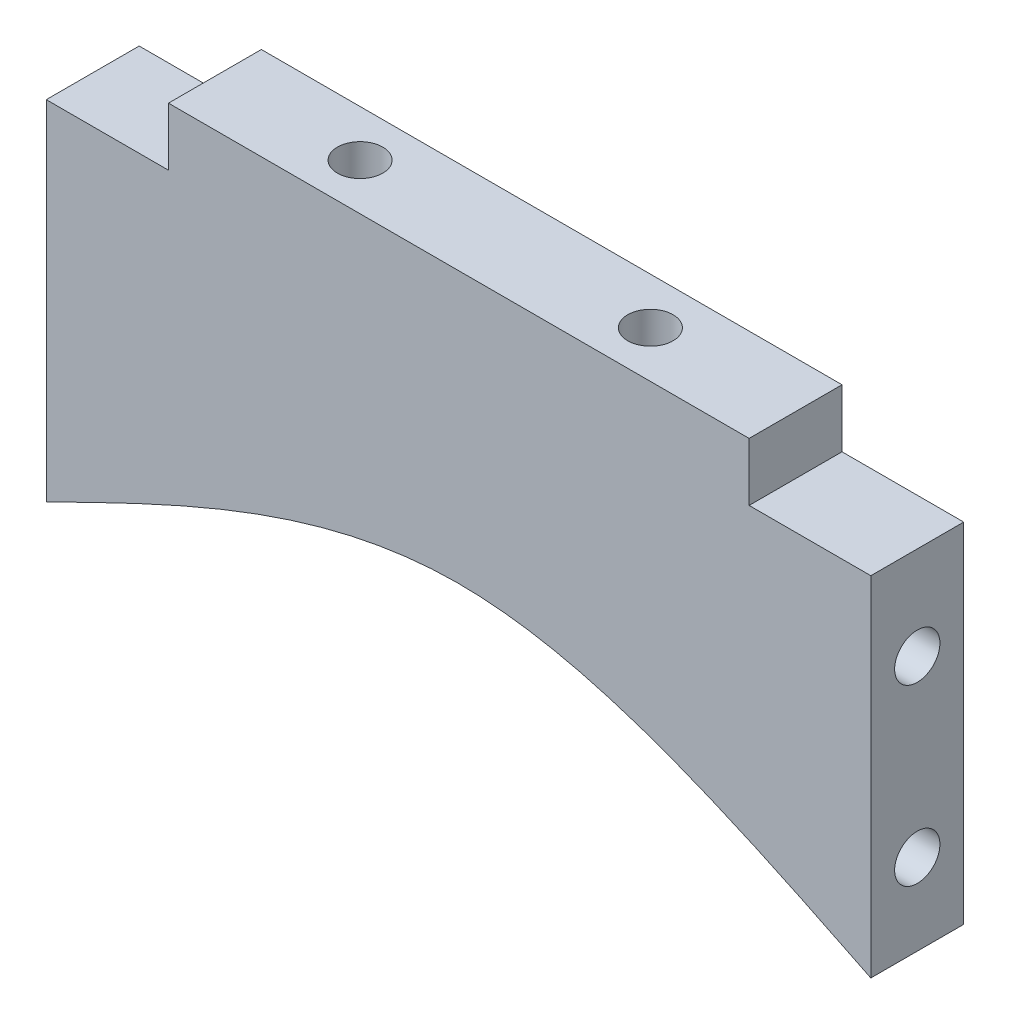
ISO-10303-21;
HEADER;
FILE_DESCRIPTION(('STEP AP214'),'2;1');
FILE_NAME('part.step','',(''),(''),'','','');
FILE_SCHEMA(('AUTOMOTIVE_DESIGN { 1 0 10303 214 1 1 1 1 }'));
ENDSEC;
DATA;
#1=APPLICATION_CONTEXT('core data for automotive mechanical design processes');
#2=APPLICATION_PROTOCOL_DEFINITION('international standard','automotive_design',2000,#1);
#3=PRODUCT_CONTEXT('',#1,'mechanical');
#4=PRODUCT('Part','Part','',(#3));
#5=PRODUCT_RELATED_PRODUCT_CATEGORY('part','',(#4));
#6=PRODUCT_DEFINITION_FORMATION('','',#4);
#7=PRODUCT_DEFINITION_CONTEXT('part definition',#1,'design');
#8=PRODUCT_DEFINITION('design','',#6,#7);
#9=PRODUCT_DEFINITION_SHAPE('','',#8);
#10=(LENGTH_UNIT() NAMED_UNIT(*) SI_UNIT(.MILLI.,.METRE.));
#11=(NAMED_UNIT(*) PLANE_ANGLE_UNIT() SI_UNIT($,.RADIAN.));
#12=(NAMED_UNIT(*) SI_UNIT($,.STERADIAN.) SOLID_ANGLE_UNIT());
#13=UNCERTAINTY_MEASURE_WITH_UNIT(LENGTH_MEASURE(1.E-05),#10,'distance_accuracy_value','');
#14=(GEOMETRIC_REPRESENTATION_CONTEXT(3) GLOBAL_UNCERTAINTY_ASSIGNED_CONTEXT((#13)) GLOBAL_UNIT_ASSIGNED_CONTEXT((#10,
#11,#12)) REPRESENTATION_CONTEXT('',''));
#15=CARTESIAN_POINT('',(0.,0.,0.));
#16=DIRECTION('',(0.,0.,1.));
#17=DIRECTION('',(1.,0.,0.));
#18=AXIS2_PLACEMENT_3D('',#15,#16,#17);
#19=CARTESIAN_POINT('',(-45.7784592925291,10.84478982375,8.));
#20=DIRECTION('',(1.,0.,0.));
#21=DIRECTION('',(0.,1.,0.));
#22=AXIS2_PLACEMENT_3D('',#19,#20,#21);
#23=PLANE('',#22);
#24=CARTESIAN_POINT('',(-45.7784592925291,-12.15521017625,4.));
#25=DIRECTION('',(-1.,0.,0.));
#26=DIRECTION('',(0.,-1.,0.));
#27=AXIS2_PLACEMENT_3D('',#24,#25,#26);
#28=CIRCLE('',#27,1.95);
#29=CARTESIAN_POINT('',(-45.7784592925291,-14.10521017625,4.));
#30=VERTEX_POINT('',#29);
#31=EDGE_CURVE('E297',#30,#30,#28,.T.);
#32=ORIENTED_EDGE('',*,*,#31,.F.);
#33=EDGE_LOOP('',(#32));
#34=FACE_BOUND('',#33,.T.);
#35=CARTESIAN_POINT('',(-45.7784592925291,2.84478982375002,4.));
#36=DIRECTION('',(-1.,0.,0.));
#37=DIRECTION('',(0.,-1.,0.));
#38=AXIS2_PLACEMENT_3D('',#35,#36,#37);
#39=CIRCLE('',#38,1.95);
#40=CARTESIAN_POINT('',(-45.7784592925291,0.894789823750017,4.));
#41=VERTEX_POINT('',#40);
#42=EDGE_CURVE('E296',#41,#41,#39,.T.);
#43=ORIENTED_EDGE('',*,*,#42,.F.);
#44=EDGE_LOOP('',(#43));
#45=FACE_BOUND('',#44,.T.);
#46=DIRECTION('',(0.,-1.,0.));
#47=VECTOR('',#46,1.);
#48=CARTESIAN_POINT('',(-45.7784592925291,10.84478982375,0.));
#49=LINE('',#48,#47);
#50=CARTESIAN_POINT('',(-45.7784592925291,10.84478982375,0.));
#51=VERTEX_POINT('',#50);
#52=CARTESIAN_POINT('',(-45.7784592925291,-19.15521017625,0.));
#53=VERTEX_POINT('',#52);
#54=EDGE_CURVE('E121',#51,#53,#49,.T.);
#55=ORIENTED_EDGE('',*,*,#54,.T.);
#56=DIRECTION('',(0.,0.,-1.));
#57=VECTOR('',#56,1.);
#58=CARTESIAN_POINT('',(-45.7784592925291,-19.15521017625,8.));
#59=LINE('',#58,#57);
#60=CARTESIAN_POINT('',(-45.7784592925291,-19.15521017625,8.));
#61=VERTEX_POINT('',#60);
#62=EDGE_CURVE('E11',#61,#53,#59,.T.);
#63=ORIENTED_EDGE('',*,*,#62,.F.);
#64=DIRECTION('',(0.,-1.,0.));
#65=VECTOR('',#64,1.);
#66=CARTESIAN_POINT('',(-45.7784592925291,10.84478982375,8.));
#67=LINE('',#66,#65);
#68=CARTESIAN_POINT('',(-45.7784592925291,10.84478982375,8.));
#69=VERTEX_POINT('',#68);
#70=EDGE_CURVE('E134',#69,#61,#67,.T.);
#71=ORIENTED_EDGE('',*,*,#70,.F.);
#72=DIRECTION('',(0.,0.,-1.));
#73=VECTOR('',#72,1.);
#74=CARTESIAN_POINT('',(-45.7784592925291,10.84478982375,8.));
#75=LINE('',#74,#73);
#76=EDGE_CURVE('E117',#69,#51,#75,.T.);
#77=ORIENTED_EDGE('',*,*,#76,.T.);
#78=EDGE_LOOP('',(#55,#63,#71,#77));
#79=FACE_BOUND('',#78,.T.);
#80=ADVANCED_FACE('F30',(#34,#45,#79),#23,.F.);
#81=CARTESIAN_POINT('',(25.2215407074709,10.84478982375,8.));
#82=DIRECTION('',(-1.,0.,0.));
#83=DIRECTION('',(0.,-1.,0.));
#84=AXIS2_PLACEMENT_3D('',#81,#82,#83);
#85=PLANE('',#84);
#86=CARTESIAN_POINT('',(25.2215407074709,-12.15521017625,4.));
#87=DIRECTION('',(1.,0.,0.));
#88=DIRECTION('',(0.,1.,0.));
#89=AXIS2_PLACEMENT_3D('',#86,#87,#88);
#90=CIRCLE('',#89,1.95);
#91=CARTESIAN_POINT('',(25.2215407074709,-10.20521017625,4.));
#92=VERTEX_POINT('',#91);
#93=EDGE_CURVE('E217',#92,#92,#90,.T.);
#94=ORIENTED_EDGE('',*,*,#93,.F.);
#95=EDGE_LOOP('',(#94));
#96=FACE_BOUND('',#95,.T.);
#97=CARTESIAN_POINT('',(25.2215407074709,2.84478982375003,4.));
#98=DIRECTION('',(1.,0.,0.));
#99=DIRECTION('',(0.,1.,0.));
#100=AXIS2_PLACEMENT_3D('',#97,#98,#99);
#101=CIRCLE('',#100,1.95);
#102=CARTESIAN_POINT('',(25.2215407074709,4.79478982375003,4.));
#103=VERTEX_POINT('',#102);
#104=EDGE_CURVE('E220',#103,#103,#101,.T.);
#105=ORIENTED_EDGE('',*,*,#104,.F.);
#106=EDGE_LOOP('',(#105));
#107=FACE_BOUND('',#106,.T.);
#108=DIRECTION('',(0.,1.,0.));
#109=VECTOR('',#108,1.);
#110=CARTESIAN_POINT('',(25.2215407074709,10.84478982375,0.));
#111=LINE('',#110,#109);
#112=CARTESIAN_POINT('',(25.2215407074709,-19.15521017625,0.));
#113=VERTEX_POINT('',#112);
#114=CARTESIAN_POINT('',(25.2215407074709,10.84478982375,0.));
#115=VERTEX_POINT('',#114);
#116=EDGE_CURVE('E124',#113,#115,#111,.T.);
#117=ORIENTED_EDGE('',*,*,#116,.T.);
#118=DIRECTION('',(0.,0.,-1.));
#119=VECTOR('',#118,1.);
#120=CARTESIAN_POINT('',(25.2215407074709,10.84478982375,8.));
#121=LINE('',#120,#119);
#122=CARTESIAN_POINT('',(25.2215407074709,10.84478982375,8.));
#123=VERTEX_POINT('',#122);
#124=EDGE_CURVE('E141',#123,#115,#121,.T.);
#125=ORIENTED_EDGE('',*,*,#124,.F.);
#126=DIRECTION('',(0.,1.,0.));
#127=VECTOR('',#126,1.);
#128=CARTESIAN_POINT('',(25.2215407074709,10.84478982375,8.));
#129=LINE('',#128,#127);
#130=CARTESIAN_POINT('',(25.2215407074709,-19.15521017625,8.));
#131=VERTEX_POINT('',#130);
#132=EDGE_CURVE('E86',#131,#123,#129,.T.);
#133=ORIENTED_EDGE('',*,*,#132,.F.);
#134=DIRECTION('',(0.,0.,-1.));
#135=VECTOR('',#134,1.);
#136=CARTESIAN_POINT('',(25.2215407074709,-19.15521017625,8.));
#137=LINE('',#136,#135);
#138=EDGE_CURVE('E38',#131,#113,#137,.T.);
#139=ORIENTED_EDGE('',*,*,#138,.T.);
#140=EDGE_LOOP('',(#117,#125,#133,#139));
#141=FACE_BOUND('',#140,.T.);
#142=ADVANCED_FACE('F147',(#96,#107,#141),#85,.F.);
#143=CARTESIAN_POINT('',(14.7422960266042,10.84478982375,8.));
#144=DIRECTION('',(0.,-1.,0.));
#145=DIRECTION('',(0.,0.,-1.));
#146=AXIS2_PLACEMENT_3D('',#143,#144,#145);
#147=PLANE('',#146);
#148=DIRECTION('',(-1.,0.,0.));
#149=VECTOR('',#148,1.);
#150=CARTESIAN_POINT('',(14.7422960266042,10.84478982375,0.));
#151=LINE('',#150,#149);
#152=CARTESIAN_POINT('',(14.7422960266042,10.84478982375,0.));
#153=VERTEX_POINT('',#152);
#154=EDGE_CURVE('E127',#115,#153,#151,.T.);
#155=ORIENTED_EDGE('',*,*,#154,.T.);
#156=DIRECTION('',(0.,0.,-1.));
#157=VECTOR('',#156,1.);
#158=CARTESIAN_POINT('',(14.7422960266042,10.84478982375,8.));
#159=LINE('',#158,#157);
#160=CARTESIAN_POINT('',(14.7422960266042,10.84478982375,8.));
#161=VERTEX_POINT('',#160);
#162=EDGE_CURVE('E138',#161,#153,#159,.T.);
#163=ORIENTED_EDGE('',*,*,#162,.F.);
#164=DIRECTION('',(-1.,0.,0.));
#165=VECTOR('',#164,1.);
#166=CARTESIAN_POINT('',(14.7422960266042,10.84478982375,8.));
#167=LINE('',#166,#165);
#168=EDGE_CURVE('E164',#123,#161,#167,.T.);
#169=ORIENTED_EDGE('',*,*,#168,.F.);
#170=ORIENTED_EDGE('',*,*,#124,.T.);
#171=EDGE_LOOP('',(#155,#163,#169,#170));
#172=FACE_BOUND('',#171,.T.);
#173=ADVANCED_FACE('F160',(#172),#147,.F.);
#174=CARTESIAN_POINT('',(14.7422960266042,10.84478982375,8.));
#175=DIRECTION('',(-1.,0.,0.));
#176=DIRECTION('',(0.,0.,1.));
#177=AXIS2_PLACEMENT_3D('',#174,#175,#176);
#178=PLANE('',#177);
#179=DIRECTION('',(0.,1.,0.));
#180=VECTOR('',#179,1.);
#181=CARTESIAN_POINT('',(14.7422960266042,10.84478982375,0.));
#182=LINE('',#181,#180);
#183=CARTESIAN_POINT('',(14.7422960266042,15.84478982375,0.));
#184=VERTEX_POINT('',#183);
#185=EDGE_CURVE('E129',#153,#184,#182,.T.);
#186=ORIENTED_EDGE('',*,*,#185,.T.);
#187=DIRECTION('',(0.,0.,-1.));
#188=VECTOR('',#187,1.);
#189=CARTESIAN_POINT('',(14.7422960266042,15.84478982375,8.));
#190=LINE('',#189,#188);
#191=CARTESIAN_POINT('',(14.7422960266042,15.84478982375,8.));
#192=VERTEX_POINT('',#191);
#193=EDGE_CURVE('E112',#192,#184,#190,.T.);
#194=ORIENTED_EDGE('',*,*,#193,.F.);
#195=DIRECTION('',(0.,1.,0.));
#196=VECTOR('',#195,1.);
#197=CARTESIAN_POINT('',(14.7422960266042,10.84478982375,8.));
#198=LINE('',#197,#196);
#199=EDGE_CURVE('E103',#161,#192,#198,.T.);
#200=ORIENTED_EDGE('',*,*,#199,.F.);
#201=ORIENTED_EDGE('',*,*,#162,.T.);
#202=EDGE_LOOP('',(#186,#194,#200,#201));
#203=FACE_BOUND('',#202,.T.);
#204=ADVANCED_FACE('F163',(#203),#178,.F.);
#205=CARTESIAN_POINT('',(14.7422960266042,15.84478982375,8.));
#206=DIRECTION('',(0.,-1.,0.));
#207=DIRECTION('',(1.,0.,0.));
#208=AXIS2_PLACEMENT_3D('',#205,#206,#207);
#209=PLANE('',#208);
#210=CARTESIAN_POINT('',(2.24229602660415,15.84478982375,3.99999999999999));
#211=DIRECTION('',(0.,1.,0.));
#212=DIRECTION('',(-1.,0.,0.));
#213=AXIS2_PLACEMENT_3D('',#210,#211,#212);
#214=CIRCLE('',#213,1.95);
#215=CARTESIAN_POINT('',(0.292296026604148,15.84478982375,3.99999999999999));
#216=VERTEX_POINT('',#215);
#217=EDGE_CURVE('E226',#216,#216,#214,.T.);
#218=ORIENTED_EDGE('',*,*,#217,.F.);
#219=EDGE_LOOP('',(#218));
#220=FACE_BOUND('',#219,.T.);
#221=CARTESIAN_POINT('',(-22.7577039733959,15.84478982375,4.));
#222=DIRECTION('',(0.,1.,0.));
#223=DIRECTION('',(-1.,0.,0.));
#224=AXIS2_PLACEMENT_3D('',#221,#222,#223);
#225=CIRCLE('',#224,1.95);
#226=CARTESIAN_POINT('',(-24.7077039733959,15.84478982375,4.));
#227=VERTEX_POINT('',#226);
#228=EDGE_CURVE('E181',#227,#227,#225,.T.);
#229=ORIENTED_EDGE('',*,*,#228,.F.);
#230=EDGE_LOOP('',(#229));
#231=FACE_BOUND('',#230,.T.);
#232=DIRECTION('',(-1.,0.,0.));
#233=VECTOR('',#232,1.);
#234=CARTESIAN_POINT('',(14.7422960266042,15.84478982375,0.));
#235=LINE('',#234,#233);
#236=CARTESIAN_POINT('',(-35.2577039733958,15.84478982375,0.));
#237=VERTEX_POINT('',#236);
#238=EDGE_CURVE('E111',#184,#237,#235,.T.);
#239=ORIENTED_EDGE('',*,*,#238,.T.);
#240=DIRECTION('',(0.,0.,-1.));
#241=VECTOR('',#240,1.);
#242=CARTESIAN_POINT('',(-35.2577039733958,15.84478982375,8.));
#243=LINE('',#242,#241);
#244=CARTESIAN_POINT('',(-35.2577039733958,15.84478982375,8.));
#245=VERTEX_POINT('',#244);
#246=EDGE_CURVE('E108',#245,#237,#243,.T.);
#247=ORIENTED_EDGE('',*,*,#246,.F.);
#248=DIRECTION('',(-1.,0.,0.));
#249=VECTOR('',#248,1.);
#250=CARTESIAN_POINT('',(14.7422960266042,15.84478982375,8.));
#251=LINE('',#250,#249);
#252=EDGE_CURVE('E97',#192,#245,#251,.T.);
#253=ORIENTED_EDGE('',*,*,#252,.F.);
#254=ORIENTED_EDGE('',*,*,#193,.T.);
#255=EDGE_LOOP('',(#239,#247,#253,#254));
#256=FACE_BOUND('',#255,.T.);
#257=ADVANCED_FACE('F109',(#220,#231,#256),#209,.F.);
#258=CARTESIAN_POINT('',(-35.2577039733958,10.84478982375,8.));
#259=DIRECTION('',(1.,0.,0.));
#260=DIRECTION('',(0.,0.,-1.));
#261=AXIS2_PLACEMENT_3D('',#258,#259,#260);
#262=PLANE('',#261);
#263=DIRECTION('',(0.,-1.,0.));
#264=VECTOR('',#263,1.);
#265=CARTESIAN_POINT('',(-35.2577039733958,10.84478982375,0.));
#266=LINE('',#265,#264);
#267=CARTESIAN_POINT('',(-35.2577039733958,10.84478982375,0.));
#268=VERTEX_POINT('',#267);
#269=EDGE_CURVE('E72',#237,#268,#266,.T.);
#270=ORIENTED_EDGE('',*,*,#269,.T.);
#271=DIRECTION('',(0.,0.,-1.));
#272=VECTOR('',#271,1.);
#273=CARTESIAN_POINT('',(-35.2577039733958,10.84478982375,8.));
#274=LINE('',#273,#272);
#275=CARTESIAN_POINT('',(-35.2577039733958,10.84478982375,8.));
#276=VERTEX_POINT('',#275);
#277=EDGE_CURVE('E113',#276,#268,#274,.T.);
#278=ORIENTED_EDGE('',*,*,#277,.F.);
#279=DIRECTION('',(0.,-1.,0.));
#280=VECTOR('',#279,1.);
#281=CARTESIAN_POINT('',(-35.2577039733958,10.84478982375,8.));
#282=LINE('',#281,#280);
#283=EDGE_CURVE('E101',#245,#276,#282,.T.);
#284=ORIENTED_EDGE('',*,*,#283,.F.);
#285=ORIENTED_EDGE('',*,*,#246,.T.);
#286=EDGE_LOOP('',(#270,#278,#284,#285));
#287=FACE_BOUND('',#286,.T.);
#288=ADVANCED_FACE('F115',(#287),#262,.F.);
#289=CARTESIAN_POINT('',(-45.7784592925291,10.84478982375,8.));
#290=DIRECTION('',(0.,-1.,0.));
#291=DIRECTION('',(0.,0.,-1.));
#292=AXIS2_PLACEMENT_3D('',#289,#290,#291);
#293=PLANE('',#292);
#294=DIRECTION('',(-1.,0.,0.));
#295=VECTOR('',#294,1.);
#296=CARTESIAN_POINT('',(-45.7784592925291,10.84478982375,0.));
#297=LINE('',#296,#295);
#298=EDGE_CURVE('E78',#268,#51,#297,.T.);
#299=ORIENTED_EDGE('',*,*,#298,.T.);
#300=ORIENTED_EDGE('',*,*,#76,.F.);
#301=DIRECTION('',(-1.,0.,0.));
#302=VECTOR('',#301,1.);
#303=CARTESIAN_POINT('',(-45.7784592925291,10.84478982375,8.));
#304=LINE('',#303,#302);
#305=EDGE_CURVE('E46',#276,#69,#304,.T.);
#306=ORIENTED_EDGE('',*,*,#305,.F.);
#307=ORIENTED_EDGE('',*,*,#277,.T.);
#308=EDGE_LOOP('',(#299,#300,#306,#307));
#309=FACE_BOUND('',#308,.T.);
#310=ADVANCED_FACE('F195',(#309),#293,.F.);
#311=CARTESIAN_POINT('',(-45.7784592925291,-19.15521017625,8.));
#312=DIRECTION('',(0.,0.,1.));
#313=DIRECTION('',(1.,0.,0.));
#314=AXIS2_PLACEMENT_3D('',#311,#312,#313);
#315=PLANE('',#314);
#316=CARTESIAN_POINT('',(25.2215407074709,-19.15521017625,8.));
#317=CARTESIAN_POINT('',(13.3906269446392,-13.3201869262196,8.));
#318=CARTESIAN_POINT('',(-10.2753645332376,-1.64808675909099,8.));
#319=CARTESIAN_POINT('',(-33.9427063095006,-13.3188178951332,8.));
#320=CARTESIAN_POINT('',(-45.7784592925291,-19.15521017625,8.));
#321=B_SPLINE_CURVE_WITH_KNOTS('',3,(#316,#317,#318,#319,#320),.UNSPECIFIED.,.F.,.F.,(4,1,4),
(0.,0.499912026668789,1.),.UNSPECIFIED.);
#322=EDGE_CURVE('E169',#131,#61,#321,.T.);
#323=ORIENTED_EDGE('',*,*,#322,.F.);
#324=ORIENTED_EDGE('',*,*,#132,.T.);
#325=ORIENTED_EDGE('',*,*,#168,.T.);
#326=ORIENTED_EDGE('',*,*,#199,.T.);
#327=ORIENTED_EDGE('',*,*,#252,.T.);
#328=ORIENTED_EDGE('',*,*,#283,.T.);
#329=ORIENTED_EDGE('',*,*,#305,.T.);
#330=ORIENTED_EDGE('',*,*,#70,.T.);
#331=EDGE_LOOP('',(#323,#324,#325,#326,#327,#328,#329,#330));
#332=FACE_BOUND('',#331,.T.);
#333=ADVANCED_FACE('F99',(#332),#315,.T.);
#334=CARTESIAN_POINT('',(-45.7784592925291,-19.15521017625,0.));
#335=DIRECTION('',(0.,0.,1.));
#336=DIRECTION('',(1.,0.,0.));
#337=AXIS2_PLACEMENT_3D('',#334,#335,#336);
#338=PLANE('',#337);
#339=ORIENTED_EDGE('',*,*,#116,.F.);
#340=CARTESIAN_POINT('',(25.2215407074709,-19.15521017625,0.));
#341=CARTESIAN_POINT('',(13.3906269446392,-13.3201869262196,0.));
#342=CARTESIAN_POINT('',(-10.2753645332376,-1.64808675909099,0.));
#343=CARTESIAN_POINT('',(-33.9427063095006,-13.3188178951332,0.));
#344=CARTESIAN_POINT('',(-45.7784592925291,-19.15521017625,0.));
#345=B_SPLINE_CURVE_WITH_KNOTS('',3,(#340,#341,#342,#343,#344),.UNSPECIFIED.,.F.,.F.,(4,1,4),
(0.,0.499912026668789,1.),.UNSPECIFIED.);
#346=EDGE_CURVE('E125',#113,#53,#345,.T.);
#347=ORIENTED_EDGE('',*,*,#346,.T.);
#348=ORIENTED_EDGE('',*,*,#54,.F.);
#349=ORIENTED_EDGE('',*,*,#298,.F.);
#350=ORIENTED_EDGE('',*,*,#269,.F.);
#351=ORIENTED_EDGE('',*,*,#238,.F.);
#352=ORIENTED_EDGE('',*,*,#185,.F.);
#353=ORIENTED_EDGE('',*,*,#154,.F.);
#354=EDGE_LOOP('',(#339,#347,#348,#349,#350,#351,#352,#353));
#355=FACE_BOUND('',#354,.T.);
#356=ADVANCED_FACE('F155',(#355),#338,.F.);
#357=DIRECTION('',(0.,0.,1.));
#358=VECTOR('',#357,1.);
#359=SURFACE_OF_LINEAR_EXTRUSION('',#345,#358);
#360=ORIENTED_EDGE('',*,*,#322,.T.);
#361=ORIENTED_EDGE('',*,*,#62,.T.);
#362=ORIENTED_EDGE('',*,*,#346,.F.);
#363=ORIENTED_EDGE('',*,*,#138,.F.);
#364=EDGE_LOOP('',(#360,#361,#362,#363));
#365=FACE_BOUND('',#364,.T.);
#366=ADVANCED_FACE('F187',(#365),#359,.F.);
#367=CARTESIAN_POINT('',(-22.7577039733959,0.844789823750029,4.));
#368=DIRECTION('',(0.,1.,0.));
#369=DIRECTION('',(-1.,0.,0.));
#370=AXIS2_PLACEMENT_3D('',#367,#368,#369);
#371=CYLINDRICAL_SURFACE('',#370,1.95);
#372=CARTESIAN_POINT('',(-22.7577039733959,0.844789823750029,4.));
#373=DIRECTION('',(0.,1.,0.));
#374=DIRECTION('',(-1.,0.,0.));
#375=AXIS2_PLACEMENT_3D('',#372,#373,#374);
#376=CIRCLE('',#375,1.95);
#377=CARTESIAN_POINT('',(-24.7077039733959,0.844789823750028,4.));
#378=VERTEX_POINT('',#377);
#379=EDGE_CURVE('E173',#378,#378,#376,.T.);
#380=ORIENTED_EDGE('',*,*,#379,.F.);
#381=EDGE_LOOP('',(#380));
#382=FACE_BOUND('',#381,.T.);
#383=ORIENTED_EDGE('',*,*,#228,.T.);
#384=EDGE_LOOP('',(#383));
#385=FACE_BOUND('',#384,.T.);
#386=ADVANCED_FACE('F191',(#382,#385),#371,.F.);
#387=CARTESIAN_POINT('',(-22.7577039733959,0.844789823750029,4.));
#388=DIRECTION('',(0.,1.,0.));
#389=DIRECTION('',(-1.,0.,0.));
#390=AXIS2_PLACEMENT_3D('',#387,#388,#389);
#391=PLANE('',#390);
#392=ORIENTED_EDGE('',*,*,#379,.T.);
#393=EDGE_LOOP('',(#392));
#394=FACE_BOUND('',#393,.T.);
#395=ADVANCED_FACE('F244',(#394),#391,.T.);
#396=CARTESIAN_POINT('',(2.24229602660415,0.844789823750032,3.99999999999999));
#397=DIRECTION('',(0.,1.,0.));
#398=DIRECTION('',(-1.,0.,0.));
#399=AXIS2_PLACEMENT_3D('',#396,#397,#398);
#400=CYLINDRICAL_SURFACE('',#399,1.95);
#401=CARTESIAN_POINT('',(2.24229602660415,0.844789823750032,3.99999999999999));
#402=DIRECTION('',(0.,1.,0.));
#403=DIRECTION('',(-1.,0.,0.));
#404=AXIS2_PLACEMENT_3D('',#401,#402,#403);
#405=CIRCLE('',#404,1.95);
#406=CARTESIAN_POINT('',(0.29229602660415,0.844789823750032,3.99999999999999));
#407=VERTEX_POINT('',#406);
#408=EDGE_CURVE('E232',#407,#407,#405,.T.);
#409=ORIENTED_EDGE('',*,*,#408,.F.);
#410=EDGE_LOOP('',(#409));
#411=FACE_BOUND('',#410,.T.);
#412=ORIENTED_EDGE('',*,*,#217,.T.);
#413=EDGE_LOOP('',(#412));
#414=FACE_BOUND('',#413,.T.);
#415=ADVANCED_FACE('F249',(#411,#414),#400,.F.);
#416=CARTESIAN_POINT('',(2.24229602660415,0.844789823750032,3.99999999999999));
#417=DIRECTION('',(0.,1.,0.));
#418=DIRECTION('',(-1.,0.,0.));
#419=AXIS2_PLACEMENT_3D('',#416,#417,#418);
#420=PLANE('',#419);
#421=ORIENTED_EDGE('',*,*,#408,.T.);
#422=EDGE_LOOP('',(#421));
#423=FACE_BOUND('',#422,.T.);
#424=ADVANCED_FACE('F253',(#423),#420,.T.);
#425=CARTESIAN_POINT('',(15.2215407074709,2.84478982375003,4.));
#426=DIRECTION('',(1.,0.,0.));
#427=DIRECTION('',(0.,1.,0.));
#428=AXIS2_PLACEMENT_3D('',#425,#426,#427);
#429=CYLINDRICAL_SURFACE('',#428,1.95);
#430=CARTESIAN_POINT('',(15.2215407074709,2.84478982375003,4.));
#431=DIRECTION('',(1.,0.,0.));
#432=DIRECTION('',(0.,1.,0.));
#433=AXIS2_PLACEMENT_3D('',#430,#431,#432);
#434=CIRCLE('',#433,1.95);
#435=CARTESIAN_POINT('',(15.2215407074709,4.79478982375003,4.));
#436=VERTEX_POINT('',#435);
#437=EDGE_CURVE('E222',#436,#436,#434,.T.);
#438=ORIENTED_EDGE('',*,*,#437,.F.);
#439=EDGE_LOOP('',(#438));
#440=FACE_BOUND('',#439,.T.);
#441=ORIENTED_EDGE('',*,*,#104,.T.);
#442=EDGE_LOOP('',(#441));
#443=FACE_BOUND('',#442,.T.);
#444=ADVANCED_FACE('F259',(#440,#443),#429,.F.);
#445=CARTESIAN_POINT('',(15.2215407074709,2.84478982375003,4.));
#446=DIRECTION('',(1.,0.,0.));
#447=DIRECTION('',(0.,1.,0.));
#448=AXIS2_PLACEMENT_3D('',#445,#446,#447);
#449=PLANE('',#448);
#450=ORIENTED_EDGE('',*,*,#437,.T.);
#451=EDGE_LOOP('',(#450));
#452=FACE_BOUND('',#451,.T.);
#453=ADVANCED_FACE('F263',(#452),#449,.T.);
#454=CARTESIAN_POINT('',(15.2215407074709,-12.15521017625,4.));
#455=DIRECTION('',(1.,0.,0.));
#456=DIRECTION('',(0.,1.,0.));
#457=AXIS2_PLACEMENT_3D('',#454,#455,#456);
#458=CYLINDRICAL_SURFACE('',#457,1.95);
#459=CARTESIAN_POINT('',(15.2215407074709,-12.15521017625,4.));
#460=DIRECTION('',(1.,0.,0.));
#461=DIRECTION('',(0.,1.,0.));
#462=AXIS2_PLACEMENT_3D('',#459,#460,#461);
#463=CIRCLE('',#462,1.95);
#464=CARTESIAN_POINT('',(15.2215407074709,-10.20521017625,4.));
#465=VERTEX_POINT('',#464);
#466=EDGE_CURVE('E223',#465,#465,#463,.T.);
#467=ORIENTED_EDGE('',*,*,#466,.F.);
#468=EDGE_LOOP('',(#467));
#469=FACE_BOUND('',#468,.T.);
#470=ORIENTED_EDGE('',*,*,#93,.T.);
#471=EDGE_LOOP('',(#470));
#472=FACE_BOUND('',#471,.T.);
#473=ADVANCED_FACE('F267',(#469,#472),#458,.F.);
#474=CARTESIAN_POINT('',(15.2215407074709,-12.15521017625,4.));
#475=DIRECTION('',(1.,0.,0.));
#476=DIRECTION('',(0.,1.,0.));
#477=AXIS2_PLACEMENT_3D('',#474,#475,#476);
#478=PLANE('',#477);
#479=ORIENTED_EDGE('',*,*,#466,.T.);
#480=EDGE_LOOP('',(#479));
#481=FACE_BOUND('',#480,.T.);
#482=ADVANCED_FACE('F271',(#481),#478,.T.);
#483=CARTESIAN_POINT('',(-35.7784592925291,2.84478982375002,4.));
#484=DIRECTION('',(-1.,0.,0.));
#485=DIRECTION('',(0.,-1.,0.));
#486=AXIS2_PLACEMENT_3D('',#483,#484,#485);
#487=CYLINDRICAL_SURFACE('',#486,1.95);
#488=CARTESIAN_POINT('',(-35.7784592925291,2.84478982375002,4.));
#489=DIRECTION('',(-1.,0.,0.));
#490=DIRECTION('',(0.,-1.,0.));
#491=AXIS2_PLACEMENT_3D('',#488,#489,#490);
#492=CIRCLE('',#491,1.95);
#493=CARTESIAN_POINT('',(-35.7784592925291,0.894789823750019,4.));
#494=VERTEX_POINT('',#493);
#495=EDGE_CURVE('E300',#494,#494,#492,.T.);
#496=ORIENTED_EDGE('',*,*,#495,.F.);
#497=EDGE_LOOP('',(#496));
#498=FACE_BOUND('',#497,.T.);
#499=ORIENTED_EDGE('',*,*,#42,.T.);
#500=EDGE_LOOP('',(#499));
#501=FACE_BOUND('',#500,.T.);
#502=ADVANCED_FACE('F275',(#498,#501),#487,.F.);
#503=CARTESIAN_POINT('',(-35.7784592925291,2.84478982375002,4.));
#504=DIRECTION('',(-1.,0.,0.));
#505=DIRECTION('',(0.,-1.,0.));
#506=AXIS2_PLACEMENT_3D('',#503,#504,#505);
#507=PLANE('',#506);
#508=ORIENTED_EDGE('',*,*,#495,.T.);
#509=EDGE_LOOP('',(#508));
#510=FACE_BOUND('',#509,.T.);
#511=ADVANCED_FACE('F279',(#510),#507,.T.);
#512=CARTESIAN_POINT('',(-35.7784592925291,-12.15521017625,4.));
#513=DIRECTION('',(-1.,0.,0.));
#514=DIRECTION('',(0.,-1.,0.));
#515=AXIS2_PLACEMENT_3D('',#512,#513,#514);
#516=CYLINDRICAL_SURFACE('',#515,1.95);
#517=CARTESIAN_POINT('',(-35.7784592925291,-12.15521017625,4.));
#518=DIRECTION('',(-1.,0.,0.));
#519=DIRECTION('',(0.,-1.,0.));
#520=AXIS2_PLACEMENT_3D('',#517,#518,#519);
#521=CIRCLE('',#520,1.95);
#522=CARTESIAN_POINT('',(-35.7784592925291,-14.10521017625,4.));
#523=VERTEX_POINT('',#522);
#524=EDGE_CURVE('E295',#523,#523,#521,.T.);
#525=ORIENTED_EDGE('',*,*,#524,.F.);
#526=EDGE_LOOP('',(#525));
#527=FACE_BOUND('',#526,.T.);
#528=ORIENTED_EDGE('',*,*,#31,.T.);
#529=EDGE_LOOP('',(#528));
#530=FACE_BOUND('',#529,.T.);
#531=ADVANCED_FACE('F283',(#527,#530),#516,.F.);
#532=CARTESIAN_POINT('',(-35.7784592925291,-12.15521017625,4.));
#533=DIRECTION('',(-1.,0.,0.));
#534=DIRECTION('',(0.,-1.,0.));
#535=AXIS2_PLACEMENT_3D('',#532,#533,#534);
#536=PLANE('',#535);
#537=ORIENTED_EDGE('',*,*,#524,.T.);
#538=EDGE_LOOP('',(#537));
#539=FACE_BOUND('',#538,.T.);
#540=ADVANCED_FACE('F287',(#539),#536,.T.);
#541=CLOSED_SHELL('',(#80,#142,#173,#204,#257,#288,#310,#333,#356,#366,#386,#395,#415,#424,#444,
#453,#473,#482,#502,#511,#531,#540));
#542=MANIFOLD_SOLID_BREP('B2',#541);
#543=ADVANCED_BREP_SHAPE_REPRESENTATION('',(#18,#542),#14);
#544=SHAPE_DEFINITION_REPRESENTATION(#9,#543);
ENDSEC;
END-ISO-10303-21;
